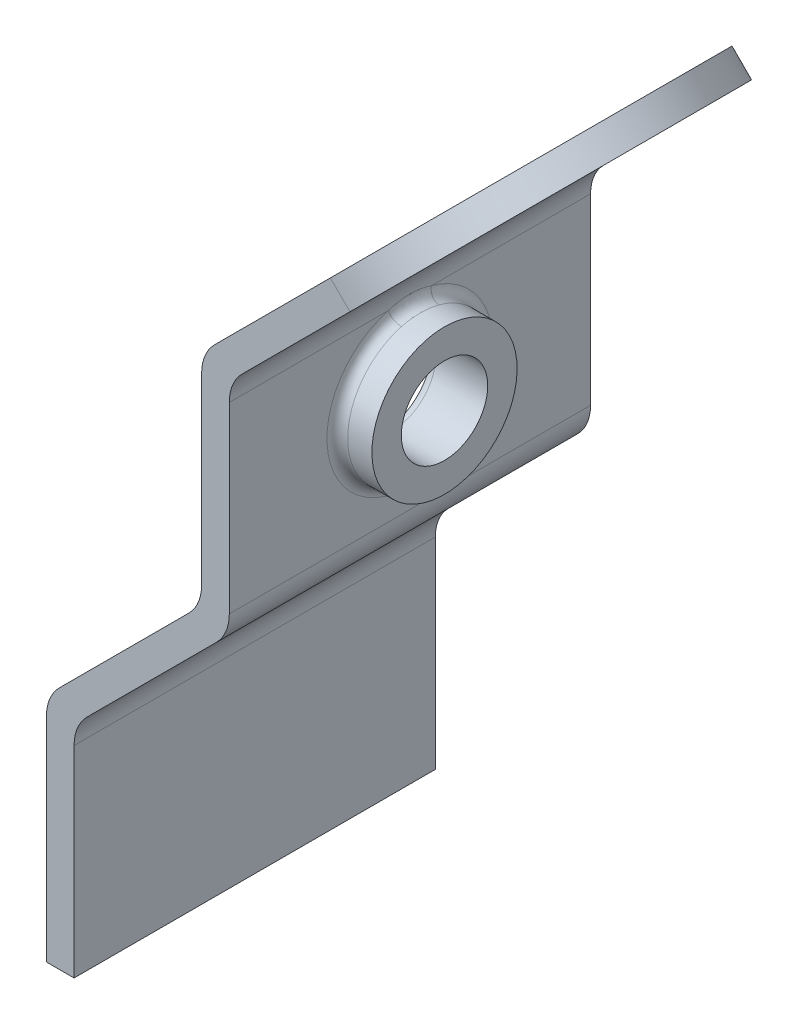
ISO-10303-21;
HEADER;
FILE_DESCRIPTION(('STEP AP214'),'2;1');
FILE_NAME('part.step','',(''),(''),'','','');
FILE_SCHEMA(('AUTOMOTIVE_DESIGN { 1 0 10303 214 1 1 1 1 }'));
ENDSEC;
DATA;
#1=APPLICATION_CONTEXT('core data for automotive mechanical design processes');
#2=APPLICATION_PROTOCOL_DEFINITION('international standard','automotive_design',2000,#1);
#3=PRODUCT_CONTEXT('',#1,'mechanical');
#4=PRODUCT('Part','Part','',(#3));
#5=PRODUCT_RELATED_PRODUCT_CATEGORY('part','',(#4));
#6=PRODUCT_DEFINITION_FORMATION('','',#4);
#7=PRODUCT_DEFINITION_CONTEXT('part definition',#1,'design');
#8=PRODUCT_DEFINITION('design','',#6,#7);
#9=PRODUCT_DEFINITION_SHAPE('','',#8);
#10=(LENGTH_UNIT() NAMED_UNIT(*) SI_UNIT(.MILLI.,.METRE.));
#11=(NAMED_UNIT(*) PLANE_ANGLE_UNIT() SI_UNIT($,.RADIAN.));
#12=(NAMED_UNIT(*) SI_UNIT($,.STERADIAN.) SOLID_ANGLE_UNIT());
#13=UNCERTAINTY_MEASURE_WITH_UNIT(LENGTH_MEASURE(1.E-05),#10,'distance_accuracy_value','');
#14=(GEOMETRIC_REPRESENTATION_CONTEXT(3) GLOBAL_UNCERTAINTY_ASSIGNED_CONTEXT((#13)) GLOBAL_UNIT_ASSIGNED_CONTEXT((#10,
#11,#12)) REPRESENTATION_CONTEXT('',''));
#15=CARTESIAN_POINT('',(0.,0.,0.));
#16=DIRECTION('',(0.,0.,1.));
#17=DIRECTION('',(1.,0.,0.));
#18=AXIS2_PLACEMENT_3D('',#15,#16,#17);
#19=CARTESIAN_POINT('',(10.5802561210692,22.7323585694968,-20.9));
#20=DIRECTION('',(1.,0.,0.));
#21=DIRECTION('',(0.,1.,0.));
#22=AXIS2_PLACEMENT_3D('',#19,#20,#21);
#23=PLANE('',#22);
#24=DIRECTION('',(0.,0.,1.));
#25=VECTOR('',#24,1.);
#26=CARTESIAN_POINT('',(10.5802561210692,33.3281536726415,-20.9));
#27=LINE('',#26,#25);
#28=CARTESIAN_POINT('',(10.5802561210692,33.3281536726415,-20.9));
#29=VERTEX_POINT('',#28);
#30=CARTESIAN_POINT('',(10.5802561210692,33.3281536726415,-11.6971287943723));
#31=VERTEX_POINT('',#30);
#32=EDGE_CURVE('E252',#29,#31,#27,.T.);
#33=ORIENTED_EDGE('',*,*,#32,.T.);
#34=CARTESIAN_POINT('',(10.5802561210692,28.6929978208661,-10.45));
#35=DIRECTION('',(1.,0.,0.));
#36=DIRECTION('',(0.,1.,0.));
#37=AXIS2_PLACEMENT_3D('',#34,#35,#36);
#38=CIRCLE('',#37,4.8);
#39=CARTESIAN_POINT('',(10.5802561210692,33.3281536726415,-9.20287120562774));
#40=VERTEX_POINT('',#39);
#41=EDGE_CURVE('E68',#31,#40,#38,.F.);
#42=ORIENTED_EDGE('',*,*,#41,.T.);
#43=CARTESIAN_POINT('',(10.5802561210692,33.3281536726415,0.));
#44=VERTEX_POINT('',#43);
#45=EDGE_CURVE('E254',#40,#44,#27,.T.);
#46=ORIENTED_EDGE('',*,*,#45,.T.);
#47=DIRECTION('',(0.,1.,0.));
#48=VECTOR('',#47,1.);
#49=CARTESIAN_POINT('',(10.5802561210692,22.7323585694968,0.));
#50=LINE('',#49,#48);
#51=CARTESIAN_POINT('',(10.5802561210692,22.7323585694968,0.));
#52=VERTEX_POINT('',#51);
#53=EDGE_CURVE('E386',#52,#44,#50,.T.);
#54=ORIENTED_EDGE('',*,*,#53,.F.);
#55=DIRECTION('',(0.,0.,1.));
#56=VECTOR('',#55,1.);
#57=CARTESIAN_POINT('',(10.5802561210692,22.7323585694968,-20.9));
#58=LINE('',#57,#56);
#59=CARTESIAN_POINT('',(10.5802561210692,22.7323585694968,-20.9));
#60=VERTEX_POINT('',#59);
#61=EDGE_CURVE('E255',#60,#52,#58,.T.);
#62=ORIENTED_EDGE('',*,*,#61,.F.);
#63=DIRECTION('',(0.,1.,0.));
#64=VECTOR('',#63,1.);
#65=CARTESIAN_POINT('',(10.5802561210692,22.7323585694968,-20.9));
#66=LINE('',#65,#64);
#67=EDGE_CURVE('E344',#60,#29,#66,.T.);
#68=ORIENTED_EDGE('',*,*,#67,.T.);
#69=EDGE_LOOP('',(#33,#42,#46,#54,#62,#68));
#70=FACE_BOUND('',#69,.T.);
#71=ADVANCED_FACE('F54',(#70),#23,.T.);
#72=CARTESIAN_POINT('',(23.8172950648814,49.8800367646782,-20.9));
#73=DIRECTION('',(-0.707106781186547,0.707106781186548,0.));
#74=DIRECTION('',(-0.707106781186548,-0.707106781186547,0.));
#75=AXIS2_PLACEMENT_3D('',#72,#73,#74);
#76=PLANE('',#75);
#77=DIRECTION('',(-0.707106781186548,-0.707106781186547,0.));
#78=VECTOR('',#77,1.);
#79=CARTESIAN_POINT('',(23.8172950648814,49.8800367646782,0.));
#80=LINE('',#79,#78);
#81=CARTESIAN_POINT('',(16.4280292014819,42.4907709012788,0.));
#82=VERTEX_POINT('',#81);
#83=CARTESIAN_POINT('',(9.72420489685533,35.7869465966522,0.));
#84=VERTEX_POINT('',#83);
#85=EDGE_CURVE('E203',#82,#84,#80,.T.);
#86=ORIENTED_EDGE('',*,*,#85,.F.);
#87=CARTESIAN_POINT('',(16.4280292014819,42.4907709012788,-10.45));
#88=DIRECTION('',(-0.707106781186547,0.707106781186548,0.));
#89=DIRECTION('',(-0.707106781186548,-0.707106781186547,0.));
#90=AXIS2_PLACEMENT_3D('',#87,#88,#89);
#91=CIRCLE('',#90,10.45);
#92=CARTESIAN_POINT('',(16.4280292014819,42.4907709012788,-20.9));
#93=VERTEX_POINT('',#92);
#94=EDGE_CURVE('E187',#82,#93,#91,.T.);
#95=ORIENTED_EDGE('',*,*,#94,.T.);
#96=DIRECTION('',(-0.707106781186548,-0.707106781186547,0.));
#97=VECTOR('',#96,1.);
#98=CARTESIAN_POINT('',(23.8172950648814,49.8800367646782,-20.9));
#99=LINE('',#98,#97);
#100=CARTESIAN_POINT('',(9.72420489685533,35.7869465966522,-20.9));
#101=VERTEX_POINT('',#100);
#102=EDGE_CURVE('E353',#93,#101,#99,.T.);
#103=ORIENTED_EDGE('',*,*,#102,.T.);
#104=DIRECTION('',(0.,0.,1.));
#105=VECTOR('',#104,1.);
#106=CARTESIAN_POINT('',(9.72420489685533,35.7869465966522,-20.9));
#107=LINE('',#106,#105);
#108=EDGE_CURVE('E212',#101,#84,#107,.T.);
#109=ORIENTED_EDGE('',*,*,#108,.T.);
#110=EDGE_LOOP('',(#86,#95,#103,#109));
#111=FACE_BOUND('',#110,.T.);
#112=ADVANCED_FACE('F210',(#111),#76,.T.);
#113=CARTESIAN_POINT('',(11.3242048968553,35.1242048968553,-20.9));
#114=DIRECTION('',(0.707106781186547,-0.707106781186548,0.));
#115=DIRECTION('',(0.707106781186548,0.707106781186547,0.));
#116=AXIS2_PLACEMENT_3D('',#113,#114,#115);
#117=PLANE('',#116);
#118=CARTESIAN_POINT('',(17.5594000513804,41.3594000513803,-10.45));
#119=DIRECTION('',(0.707106781186547,-0.707106781186548,0.));
#120=DIRECTION('',(0.707106781186548,0.707106781186547,0.));
#121=AXIS2_PLACEMENT_3D('',#118,#119,#120);
#122=CIRCLE('',#121,10.45);
#123=CARTESIAN_POINT('',(17.5594000513804,41.3594000513803,-20.9));
#124=VERTEX_POINT('',#123);
#125=CARTESIAN_POINT('',(17.5594000513804,41.3594000513803,0.));
#126=VERTEX_POINT('',#125);
#127=EDGE_CURVE('E197',#124,#126,#122,.T.);
#128=ORIENTED_EDGE('',*,*,#127,.T.);
#129=DIRECTION('',(0.707106781186549,0.707106781186547,0.));
#130=VECTOR('',#129,1.);
#131=CARTESIAN_POINT('',(11.3242048968553,35.1242048968553,0.));
#132=LINE('',#131,#130);
#133=CARTESIAN_POINT('',(11.3242048968553,35.1242048968553,0.));
#134=VERTEX_POINT('',#133);
#135=EDGE_CURVE('E207',#134,#126,#132,.T.);
#136=ORIENTED_EDGE('',*,*,#135,.F.);
#137=DIRECTION('',(0.,0.,1.));
#138=VECTOR('',#137,1.);
#139=CARTESIAN_POINT('',(11.3242048968553,35.1242048968553,-20.9));
#140=LINE('',#139,#138);
#141=CARTESIAN_POINT('',(11.3242048968553,35.1242048968553,-20.9));
#142=VERTEX_POINT('',#141);
#143=EDGE_CURVE('E250',#142,#134,#140,.T.);
#144=ORIENTED_EDGE('',*,*,#143,.F.);
#145=DIRECTION('',(0.707106781186549,0.707106781186547,0.));
#146=VECTOR('',#145,1.);
#147=CARTESIAN_POINT('',(11.3242048968553,35.1242048968553,-20.9));
#148=LINE('',#147,#146);
#149=EDGE_CURVE('E350',#142,#124,#148,.T.);
#150=ORIENTED_EDGE('',*,*,#149,.T.);
#151=EDGE_LOOP('',(#128,#136,#144,#150));
#152=FACE_BOUND('',#151,.T.);
#153=ADVANCED_FACE('F310',(#152),#117,.T.);
#154=CARTESIAN_POINT('',(0.,0.,-20.9));
#155=DIRECTION('',(0.,-1.,0.));
#156=DIRECTION('',(0.,0.,-1.));
#157=AXIS2_PLACEMENT_3D('',#154,#155,#156);
#158=PLANE('',#157);
#159=DIRECTION('',(1.,0.,0.));
#160=VECTOR('',#159,1.);
#161=CARTESIAN_POINT('',(0.,0.,0.));
#162=LINE('',#161,#160);
#163=CARTESIAN_POINT('',(0.,0.,0.));
#164=VERTEX_POINT('',#163);
#165=CARTESIAN_POINT('',(1.6,0.,0.));
#166=VERTEX_POINT('',#165);
#167=EDGE_CURVE('E329',#164,#166,#162,.T.);
#168=ORIENTED_EDGE('',*,*,#167,.F.);
#169=DIRECTION('',(0.,0.,1.));
#170=VECTOR('',#169,1.);
#171=CARTESIAN_POINT('',(0.,0.,-20.9));
#172=LINE('',#171,#170);
#173=CARTESIAN_POINT('',(0.,0.,-20.9));
#174=VERTEX_POINT('',#173);
#175=EDGE_CURVE('E237',#174,#164,#172,.T.);
#176=ORIENTED_EDGE('',*,*,#175,.F.);
#177=DIRECTION('',(1.,0.,0.));
#178=VECTOR('',#177,1.);
#179=CARTESIAN_POINT('',(0.,0.,-20.9));
#180=LINE('',#179,#178);
#181=CARTESIAN_POINT('',(1.6,0.,-20.9));
#182=VERTEX_POINT('',#181);
#183=EDGE_CURVE('E236',#174,#182,#180,.T.);
#184=ORIENTED_EDGE('',*,*,#183,.T.);
#185=DIRECTION('',(0.,0.,1.));
#186=VECTOR('',#185,1.);
#187=CARTESIAN_POINT('',(1.6,0.,-20.9));
#188=LINE('',#187,#186);
#189=EDGE_CURVE('E263',#182,#166,#188,.T.);
#190=ORIENTED_EDGE('',*,*,#189,.T.);
#191=EDGE_LOOP('',(#168,#176,#184,#190));
#192=FACE_BOUND('',#191,.T.);
#193=ADVANCED_FACE('F291',(#192),#158,.T.);
#194=CARTESIAN_POINT('',(0.,12.3106392513693,-20.9));
#195=DIRECTION('',(-1.,0.,0.));
#196=DIRECTION('',(0.,-1.,0.));
#197=AXIS2_PLACEMENT_3D('',#194,#195,#196);
#198=PLANE('',#197);
#199=DIRECTION('',(0.,-1.,0.));
#200=VECTOR('',#199,1.);
#201=CARTESIAN_POINT('',(0.,12.3106392513693,0.));
#202=LINE('',#201,#200);
#203=CARTESIAN_POINT('',(0.,12.3106392513693,0.));
#204=VERTEX_POINT('',#203);
#205=EDGE_CURVE('E233',#204,#164,#202,.T.);
#206=ORIENTED_EDGE('',*,*,#205,.F.);
#207=DIRECTION('',(0.,0.,1.));
#208=VECTOR('',#207,1.);
#209=CARTESIAN_POINT('',(0.,12.3106392513693,-20.9));
#210=LINE('',#209,#208);
#211=CARTESIAN_POINT('',(0.,12.3106392513693,-20.9));
#212=VERTEX_POINT('',#211);
#213=EDGE_CURVE('E239',#212,#204,#210,.T.);
#214=ORIENTED_EDGE('',*,*,#213,.F.);
#215=DIRECTION('',(0.,-1.,0.));
#216=VECTOR('',#215,1.);
#217=CARTESIAN_POINT('',(0.,12.3106392513693,-20.9));
#218=LINE('',#217,#216);
#219=EDGE_CURVE('E265',#212,#174,#218,.T.);
#220=ORIENTED_EDGE('',*,*,#219,.T.);
#221=ORIENTED_EDGE('',*,*,#175,.T.);
#222=EDGE_LOOP('',(#206,#214,#220,#221));
#223=FACE_BOUND('',#222,.T.);
#224=ADVANCED_FACE('F413',(#223),#198,.T.);
#225=CARTESIAN_POINT('',(2.54,12.3106392513693,-20.9));
#226=DIRECTION('',(0.,0.,1.));
#227=DIRECTION('',(1.,0.,0.));
#228=AXIS2_PLACEMENT_3D('',#225,#226,#227);
#229=CYLINDRICAL_SURFACE('',#228,2.54);
#230=CARTESIAN_POINT('',(2.54,12.3106392513693,0.));
#231=DIRECTION('',(0.,0.,1.));
#232=DIRECTION('',(1.,0.,0.));
#233=AXIS2_PLACEMENT_3D('',#230,#231,#232);
#234=CIRCLE('',#233,2.54);
#235=CARTESIAN_POINT('',(0.743948775786169,14.1066904755831,0.));
#236=VERTEX_POINT('',#235);
#237=EDGE_CURVE('E230',#236,#204,#234,.T.);
#238=ORIENTED_EDGE('',*,*,#237,.F.);
#239=DIRECTION('',(0.,0.,1.));
#240=VECTOR('',#239,1.);
#241=CARTESIAN_POINT('',(0.743948775786169,14.1066904755831,-20.9));
#242=LINE('',#241,#240);
#243=CARTESIAN_POINT('',(0.743948775786169,14.1066904755831,-20.9));
#244=VERTEX_POINT('',#243);
#245=EDGE_CURVE('E241',#244,#236,#242,.T.);
#246=ORIENTED_EDGE('',*,*,#245,.F.);
#247=CARTESIAN_POINT('',(2.54,12.3106392513693,-20.9));
#248=DIRECTION('',(0.,0.,1.));
#249=DIRECTION('',(1.,0.,0.));
#250=AXIS2_PLACEMENT_3D('',#247,#248,#249);
#251=CIRCLE('',#250,2.54);
#252=EDGE_CURVE('E367',#244,#212,#251,.T.);
#253=ORIENTED_EDGE('',*,*,#252,.T.);
#254=ORIENTED_EDGE('',*,*,#213,.T.);
#255=EDGE_LOOP('',(#238,#246,#253,#254));
#256=FACE_BOUND('',#255,.T.);
#257=ADVANCED_FACE('F451',(#256),#229,.T.);
#258=CARTESIAN_POINT('',(8.23630734528299,21.5990490450799,-20.9));
#259=DIRECTION('',(-0.707106781186546,0.707106781186549,0.));
#260=DIRECTION('',(-0.707106781186549,-0.707106781186546,0.));
#261=AXIS2_PLACEMENT_3D('',#258,#259,#260);
#262=PLANE('',#261);
#263=DIRECTION('',(-0.707106781186549,-0.707106781186546,0.));
#264=VECTOR('',#263,1.);
#265=CARTESIAN_POINT('',(8.23630734528299,21.5990490450799,0.));
#266=LINE('',#265,#264);
#267=CARTESIAN_POINT('',(8.23630734528299,21.5990490450799,0.));
#268=VERTEX_POINT('',#267);
#269=EDGE_CURVE('E227',#268,#236,#266,.T.);
#270=ORIENTED_EDGE('',*,*,#269,.F.);
#271=DIRECTION('',(0.,0.,1.));
#272=VECTOR('',#271,1.);
#273=CARTESIAN_POINT('',(8.23630734528299,21.5990490450799,-20.9));
#274=LINE('',#273,#272);
#275=CARTESIAN_POINT('',(8.23630734528299,21.5990490450799,-20.9));
#276=VERTEX_POINT('',#275);
#277=EDGE_CURVE('E243',#276,#268,#274,.T.);
#278=ORIENTED_EDGE('',*,*,#277,.F.);
#279=DIRECTION('',(-0.707106781186549,-0.707106781186546,0.));
#280=VECTOR('',#279,1.);
#281=CARTESIAN_POINT('',(8.23630734528299,21.5990490450799,-20.9));
#282=LINE('',#281,#280);
#283=EDGE_CURVE('E364',#276,#244,#282,.T.);
#284=ORIENTED_EDGE('',*,*,#283,.T.);
#285=ORIENTED_EDGE('',*,*,#245,.T.);
#286=EDGE_LOOP('',(#270,#278,#284,#285));
#287=FACE_BOUND('',#286,.T.);
#288=ADVANCED_FACE('F408',(#287),#262,.T.);
#289=CARTESIAN_POINT('',(6.44025612106916,23.3951002692938,-20.9));
#290=DIRECTION('',(0.,0.,1.));
#291=DIRECTION('',(1.,0.,0.));
#292=AXIS2_PLACEMENT_3D('',#289,#290,#291);
#293=CYLINDRICAL_SURFACE('',#292,2.54);
#294=CARTESIAN_POINT('',(6.44025612106916,23.3951002692938,0.));
#295=DIRECTION('',(0.,0.,-1.));
#296=DIRECTION('',(-1.,0.,0.));
#297=AXIS2_PLACEMENT_3D('',#294,#295,#296);
#298=CIRCLE('',#297,2.54);
#299=CARTESIAN_POINT('',(8.98025612106916,23.3951002692938,0.));
#300=VERTEX_POINT('',#299);
#301=EDGE_CURVE('E224',#300,#268,#298,.T.);
#302=ORIENTED_EDGE('',*,*,#301,.F.);
#303=DIRECTION('',(0.,0.,1.));
#304=VECTOR('',#303,1.);
#305=CARTESIAN_POINT('',(8.98025612106916,23.3951002692938,-20.9));
#306=LINE('',#305,#304);
#307=CARTESIAN_POINT('',(8.98025612106916,23.3951002692938,-20.9));
#308=VERTEX_POINT('',#307);
#309=EDGE_CURVE('E245',#308,#300,#306,.T.);
#310=ORIENTED_EDGE('',*,*,#309,.F.);
#311=CARTESIAN_POINT('',(6.44025612106916,23.3951002692938,-20.9));
#312=DIRECTION('',(0.,0.,-1.));
#313=DIRECTION('',(-1.,0.,0.));
#314=AXIS2_PLACEMENT_3D('',#311,#312,#313);
#315=CIRCLE('',#314,2.54);
#316=EDGE_CURVE('E361',#308,#276,#315,.T.);
#317=ORIENTED_EDGE('',*,*,#316,.T.);
#318=ORIENTED_EDGE('',*,*,#277,.T.);
#319=EDGE_LOOP('',(#302,#310,#317,#318));
#320=FACE_BOUND('',#319,.T.);
#321=ADVANCED_FACE('F404',(#320),#293,.F.);
#322=CARTESIAN_POINT('',(8.98025612106916,33.9908953724384,-20.9));
#323=DIRECTION('',(-1.,0.,0.));
#324=DIRECTION('',(0.,-1.,0.));
#325=AXIS2_PLACEMENT_3D('',#322,#323,#324);
#326=PLANE('',#325);
#327=CARTESIAN_POINT('',(8.98025612106916,28.6929978208661,-10.45));
#328=DIRECTION('',(-1.,0.,0.));
#329=DIRECTION('',(0.,-1.,0.));
#330=AXIS2_PLACEMENT_3D('',#327,#328,#329);
#331=CIRCLE('',#330,3.1);
#332=CARTESIAN_POINT('',(8.98025612106916,25.5929978208661,-10.45));
#333=VERTEX_POINT('',#332);
#334=EDGE_CURVE('E269',#333,#333,#331,.F.);
#335=ORIENTED_EDGE('',*,*,#334,.T.);
#336=EDGE_LOOP('',(#335));
#337=FACE_BOUND('',#336,.T.);
#338=DIRECTION('',(0.,-1.,0.));
#339=VECTOR('',#338,1.);
#340=CARTESIAN_POINT('',(8.98025612106916,33.9908953724384,0.));
#341=LINE('',#340,#339);
#342=CARTESIAN_POINT('',(8.98025612106916,33.9908953724384,0.));
#343=VERTEX_POINT('',#342);
#344=EDGE_CURVE('E216',#343,#300,#341,.T.);
#345=ORIENTED_EDGE('',*,*,#344,.F.);
#346=DIRECTION('',(0.,0.,1.));
#347=VECTOR('',#346,1.);
#348=CARTESIAN_POINT('',(8.98025612106916,33.9908953724384,-20.9));
#349=LINE('',#348,#347);
#350=CARTESIAN_POINT('',(8.98025612106916,33.9908953724384,-20.9));
#351=VERTEX_POINT('',#350);
#352=EDGE_CURVE('E247',#351,#343,#349,.T.);
#353=ORIENTED_EDGE('',*,*,#352,.F.);
#354=DIRECTION('',(0.,-1.,0.));
#355=VECTOR('',#354,1.);
#356=CARTESIAN_POINT('',(8.98025612106916,33.9908953724384,-20.9));
#357=LINE('',#356,#355);
#358=EDGE_CURVE('E358',#351,#308,#357,.T.);
#359=ORIENTED_EDGE('',*,*,#358,.T.);
#360=ORIENTED_EDGE('',*,*,#309,.T.);
#361=EDGE_LOOP('',(#345,#353,#359,#360));
#362=FACE_BOUND('',#361,.T.);
#363=ADVANCED_FACE('F401',(#337,#362),#326,.T.);
#364=CARTESIAN_POINT('',(11.5202561210692,33.9908953724384,-20.9));
#365=DIRECTION('',(0.,0.,1.));
#366=DIRECTION('',(1.,0.,0.));
#367=AXIS2_PLACEMENT_3D('',#364,#365,#366);
#368=CYLINDRICAL_SURFACE('',#367,2.54);
#369=CARTESIAN_POINT('',(11.5202561210692,33.9908953724384,0.));
#370=DIRECTION('',(0.,0.,1.));
#371=DIRECTION('',(1.,0.,0.));
#372=AXIS2_PLACEMENT_3D('',#369,#370,#371);
#373=CIRCLE('',#372,2.54);
#374=EDGE_CURVE('E214',#84,#343,#373,.T.);
#375=ORIENTED_EDGE('',*,*,#374,.F.);
#376=ORIENTED_EDGE('',*,*,#108,.F.);
#377=CARTESIAN_POINT('',(11.5202561210692,33.9908953724384,-20.9));
#378=DIRECTION('',(0.,0.,1.));
#379=DIRECTION('',(1.,0.,0.));
#380=AXIS2_PLACEMENT_3D('',#377,#378,#379);
#381=CIRCLE('',#380,2.54);
#382=EDGE_CURVE('E355',#101,#351,#381,.T.);
#383=ORIENTED_EDGE('',*,*,#382,.T.);
#384=ORIENTED_EDGE('',*,*,#352,.T.);
#385=EDGE_LOOP('',(#375,#376,#383,#384));
#386=FACE_BOUND('',#385,.T.);
#387=ADVANCED_FACE('F308',(#386),#368,.T.);
#388=CARTESIAN_POINT('',(13.1202561210692,33.3281536726415,-20.9));
#389=DIRECTION('',(0.,0.,1.));
#390=DIRECTION('',(1.,0.,0.));
#391=AXIS2_PLACEMENT_3D('',#388,#389,#390);
#392=CYLINDRICAL_SURFACE('',#391,2.54);
#393=ORIENTED_EDGE('',*,*,#45,.F.);
#394=CARTESIAN_POINT('',(11.2775078538272,32.2180453094019,-12.7334272932518));
#395=CARTESIAN_POINT('',(10.8260491574233,32.1741235022297,-12.8012317101132));
#396=CARTESIAN_POINT('',(10.7075857093193,32.534036877537,-13.0596311922878));
#397=CARTESIAN_POINT('',(11.2580523767097,32.2699206425587,-12.6533942841327));
#398=CARTESIAN_POINT('',(10.7937907819477,32.2331836147482,-12.7135117701608));
#399=CARTESIAN_POINT('',(10.6821130757417,32.6116588786999,-12.9681648962105));
#400=CARTESIAN_POINT('',(11.2425822940814,32.3193103017998,-12.5711263801209));
#401=CARTESIAN_POINT('',(10.7660906248619,32.2882450119713,-12.6245785382055));
#402=CARTESIAN_POINT('',(10.6618584315249,32.6855615205437,-12.8741444344879));
#403=CARTESIAN_POINT('',(11.2178809343335,32.4125808921157,-12.4029156733101));
#404=CARTESIAN_POINT('',(10.717430545466,32.391402145407,-12.4437107783533));
#405=CARTESIAN_POINT('',(10.6295174753223,32.8251239942297,-12.68190362668));
#406=CARTESIAN_POINT('',(11.2086442125996,32.4564666033347,-12.3169761474992));
#407=CARTESIAN_POINT('',(10.6965896166801,32.4393730687844,-12.3517303121185));
#408=CARTESIAN_POINT('',(10.6174240348217,32.8907909786886,-12.583687025724));
#409=CARTESIAN_POINT('',(11.1947158542805,32.5378973760808,-12.1429018867758));
#410=CARTESIAN_POINT('',(10.6601485175915,32.5276190140171,-12.1666802144119));
#411=CARTESIAN_POINT('',(10.5991879366187,33.0126373189215,-12.3847450134476));
#412=CARTESIAN_POINT('',(11.189982046186,32.575498494785,-12.0547956108171));
#413=CARTESIAN_POINT('',(10.6446041008984,32.5678012457572,-12.0736595424521));
#414=CARTESIAN_POINT('',(10.5929900646609,33.0689005540621,-12.2840521266458));
#415=CARTESIAN_POINT('',(11.1835049708901,32.6446077482351,-11.8761631633722));
#416=CARTESIAN_POINT('',(10.617352824279,32.6410659349035,-11.8863664493524));
#417=CARTESIAN_POINT('',(10.5845097702311,33.1723099819413,-12.0799007581426));
#418=CARTESIAN_POINT('',(11.1817609323128,32.6761174527354,-11.7856376221921));
#419=CARTESIAN_POINT('',(10.6057337887405,32.6739670917682,-11.7922269679158));
#420=CARTESIAN_POINT('',(10.5822263378135,33.2194585235318,-11.9764429967914));
#421=CARTESIAN_POINT('',(11.1806819439876,32.7123472402715,-11.668825151));
#422=CARTESIAN_POINT('',(10.5928900718615,32.711311679181,-11.6722602719185));
#423=CARTESIAN_POINT('',(10.5808136418082,33.2736698109133,-11.8429430297142));
#424=CARTESIAN_POINT('',(11.1805168872852,32.7199643968682,-11.643416823191));
#425=CARTESIAN_POINT('',(10.5902078692293,32.719179562324,-11.6460811046578));
#426=CARTESIAN_POINT('',(10.5805975366905,33.2850675003145,-11.8139049407897));
#427=CARTESIAN_POINT('',(11.1803041551556,32.7347219042148,-11.5924408445954));
#428=CARTESIAN_POINT('',(10.5850652047428,32.7343812484922,-11.5936645069745));
#429=CARTESIAN_POINT('',(10.5803190111259,33.3071494258888,-11.7556466795377));
#430=CARTESIAN_POINT('',(11.1802565693442,32.7418618869029,-11.5668730870806));
#431=CARTESIAN_POINT('',(10.5826063558554,32.7417108770954,-11.5674321813049));
#432=CARTESIAN_POINT('',(10.580256708011,33.3178331113242,-11.726426385235));
#433=CARTESIAN_POINT('',(11.1802541318673,32.7793656888156,-11.4274817210431));
#434=CARTESIAN_POINT('',(10.5697148300781,32.7803723432194,-11.4237499856287));
#435=CARTESIAN_POINT('',(10.5802535165394,33.3739507294989,-11.5671219669064));
#436=CARTESIAN_POINT('',(11.1811803294513,32.8051935976453,-11.3123939540302));
#437=CARTESIAN_POINT('',(10.5613820579649,32.8062548892592,-11.3073078735361));
#438=CARTESIAN_POINT('',(10.5814661672138,33.4125974973455,-11.4355930903202));
#439=CARTESIAN_POINT('',(11.1833656953447,32.8470931737154,-11.0803990582023));
#440=CARTESIAN_POINT('',(10.5480212856553,32.8481117959283,-11.0739575291851));
#441=CARTESIAN_POINT('',(10.5843274195273,33.475292592027,-11.1704560665169));
#442=CARTESIAN_POINT('',(11.1846251044633,32.8631577572827,-10.9634906713792));
#443=CARTESIAN_POINT('',(10.5430759233576,32.8638334300432,-10.9576868684035));
#444=CARTESIAN_POINT('',(10.5859763364527,33.4993303194335,-11.0368464815763));
#445=CARTESIAN_POINT('',(11.1865099224934,32.8854108747262,-10.7285781347404));
#446=CARTESIAN_POINT('',(10.5362193499767,32.8856660853559,-10.7245442279511));
#447=CARTESIAN_POINT('',(10.5884440878706,33.5326280621742,-10.7683750111319));
#448=CARTESIAN_POINT('',(11.1871345403335,32.8915870913054,-10.6105728021773));
#449=CARTESIAN_POINT('',(10.5343559244339,32.8916253821386,-10.6084090229544));
#450=CARTESIAN_POINT('',(10.5892618866311,33.5418696469138,-10.6335117739169));
#451=CARTESIAN_POINT('',(11.1873681072824,32.8939775411525,-10.3745199154819));
#452=CARTESIAN_POINT('',(10.5336285095313,32.8939515928932,-10.3754640520442));
#453=CARTESIAN_POINT('',(10.5895676907934,33.54544652032,-10.3637370462651));
#454=CARTESIAN_POINT('',(11.1869775239409,32.8901963602774,-10.2564724058119));
#455=CARTESIAN_POINT('',(10.5347679455601,32.890307552617,-10.2594292276539));
#456=CARTESIAN_POINT('',(10.589056308348,33.5397886708877,-10.2288256066425));
#457=CARTESIAN_POINT('',(11.185312955575,32.871657912752,-10.0069805267081));
#458=CARTESIAN_POINT('',(10.5404491366725,32.8721838145585,-10.0124327072074));
#459=CARTESIAN_POINT('',(10.5868769249943,33.5120492560474,-9.9436920305232));
#460=CARTESIAN_POINT('',(11.1839385576132,32.8556375933182,-9.87562896944069));
#461=CARTESIAN_POINT('',(10.5453381358532,32.8565985340662,-9.88225427619368));
#462=CARTESIAN_POINT('',(10.5850774556311,33.4880777618796,-9.79357596507373));
#463=CARTESIAN_POINT('',(11.181408949582,32.8113199333874,-9.6152328864585));
#464=CARTESIAN_POINT('',(10.5593885515555,32.8124365526125,-9.62082969872009));
#465=CARTESIAN_POINT('',(10.5817654943653,33.4217644444879,-9.49598044166819));
#466=CARTESIAN_POINT('',(11.1802533796152,32.7830430072828,-9.48618489448167));
#467=CARTESIAN_POINT('',(10.5684364146698,32.7842101124853,-9.49050362552364));
#468=CARTESIAN_POINT('',(10.5802525312577,33.3794531676895,-9.34849702226978));
#469=CARTESIAN_POINT('',(11.180258388065,32.7204088082085,-9.25339249428527));
#470=CARTESIAN_POINT('',(10.5898574929933,32.7199617346925,-9.25174632888251));
#471=CARTESIAN_POINT('',(10.5802590895989,33.285732481094,-9.0824485648933));
#472=CARTESIAN_POINT('',(11.1810527274672,32.6879508150325,-9.14913416056226));
#473=CARTESIAN_POINT('',(10.601253296544,32.6865012069801,-9.14419044513827));
#474=CARTESIAN_POINT('',(10.5812991019655,33.2371649980306,-8.9632961834855));
#475=CARTESIAN_POINT('',(11.1858341313062,32.6150371326497,-8.94351249012573));
#476=CARTESIAN_POINT('',(10.6287314783484,32.6099174966976,-8.92991444357716));
#477=CARTESIAN_POINT('',(10.587559290175,33.1280629341249,-8.72829998872838));
#478=CARTESIAN_POINT('',(11.1898207867006,32.5745824685839,-8.84214878423687));
#479=CARTESIAN_POINT('',(10.6446930435603,32.5670681436151,-8.82344485934275));
#480=CARTESIAN_POINT('',(10.5927789304678,33.0675298872196,-8.61245575346439));
#481=CARTESIAN_POINT('',(11.2030100861391,32.4856562580273,-8.64229949489166));
#482=CARTESIAN_POINT('',(10.683034254348,32.4712738937128,-8.6117688614955));
#483=CARTESIAN_POINT('',(10.610047395168,32.9344679879333,-8.38405656553926));
#484=CARTESIAN_POINT('',(11.2122517896091,32.4371266251848,-8.54384133886634));
#485=CARTESIAN_POINT('',(10.7053114793828,32.4185104847598,-8.50666821016905));
#486=CARTESIAN_POINT('',(10.6221473592596,32.8618522198991,-8.27153295851225));
#487=CARTESIAN_POINT('',(11.231863957961,32.3589131791823,-8.39961796205613));
#488=CARTESIAN_POINT('',(10.7453895923585,32.3317784034554,-8.3509870895541));
#489=CARTESIAN_POINT('',(10.6478251460049,32.7448200234807,-8.10670624222961));
#490=CARTESIAN_POINT('',(11.2393684637464,32.331913555983,-8.35208181047684));
#491=CARTESIAN_POINT('',(10.7597380273724,32.3018349532772,-8.29976737284915));
#492=CARTESIAN_POINT('',(10.6576506321626,32.7044199978488,-8.05237921192463));
#493=CARTESIAN_POINT('',(11.2566478744233,32.2762197621353,-8.25831128595054));
#494=CARTESIAN_POINT('',(10.7909216765811,32.2397023950123,-8.19848554335118));
#495=CARTESIAN_POINT('',(10.6802741893857,32.6210843647656,-7.94521289827575));
#496=CARTESIAN_POINT('',(11.2664237294882,32.2475248860686,-8.21207746690902));
#497=CARTESIAN_POINT('',(10.8077343352305,32.207532266539,-8.14840819664612));
#498=CARTESIAN_POINT('',(10.6930735044926,32.5781477017841,-7.89237424796668));
#499=CARTESIAN_POINT('',(11.2775078538272,32.2180453094019,-8.1665727067482));
#500=CARTESIAN_POINT('',(10.8260491574233,32.1741235022297,-8.0987682898868));
#501=CARTESIAN_POINT('',(10.7075857093193,32.534036877537,-7.84036880771223));
#502=(BOUNDED_SURFACE() B_SPLINE_SURFACE(3,2,((#394,#395,#396),(#397,#398,#399),(#400,#401,
#402),(#403,#404,#405),(#406,#407,#408),(#409,#410,#411),(#412,#413,#414),(#415,#416,#417),
(#418,#419,#420),(#421,#422,#423),(#424,#425,#426),(#427,#428,#429),(#430,#431,#432),(#433,#434,
#435),(#436,#437,#438),(#439,#440,#441),(#442,#443,#444),(#445,#446,#447),(#448,#449,#450),
(#451,#452,#453),(#454,#455,#456),(#457,#458,#459),(#460,#461,#462),(#463,#464,#465),(#466,#467,
#468),(#469,#470,#471),(#472,#473,#474),(#475,#476,#477),(#478,#479,#480),(#481,#482,#483),
(#484,#485,#486),(#487,#488,#489),(#490,#491,#492),(#493,#494,#495),(#496,#497,#498),(#499,#500,
#501)),.UNSPECIFIED.,.F.,.F.,.F.) B_SPLINE_SURFACE_WITH_KNOTS((4,2,2,2,2,2,2,2,2,2,2,2,2,2,2,2,
2,4),(3,3),(0.,0.331874201120749,0.663458145682873,0.991905183764777,1.32026746805021,
1.41121006638871,1.50222202125563,1.90608374385047,2.31023813514567,2.714895564754,
3.11936666288323,3.57238921651035,4.02466010570663,4.39865735468485,4.77260668978403,
5.14937252180306,5.33807711724488,5.52686079605431),(0.,1.),
.UNSPECIFIED.) GEOMETRIC_REPRESENTATION_ITEM() RATIONAL_B_SPLINE_SURFACE(((1.,0.794481440906599,
1.),(1.,0.787631474744811,1.),(1.,0.780653496274145,1.),(1.,0.766741995702262,1.),(1.,
0.759808440057197,1.),(1.,0.746337278907262,1.),(1.,0.739796548111348,1.),(1.,0.727314365115548,
1.),(1.,0.721372758710924,1.),(1.,0.71433221830749,1.),(1.,0.712838039177156,1.),(1.,
0.709918876316959,1.),(1.,0.708493946227371,1.),(1.,0.70095129464932,1.),(1.,0.69553944093549,
1.),(1.,0.686588259108845,1.),(1.,0.683050290811537,1.),(1.,0.678112759072646,1.),(1.,
0.676715862717636,1.),(1.,0.676177405195194,1.),(1.,0.677034805816037,1.),(1.,0.681172491861099,
1.),(1.,0.684731258696012,1.),(1.,0.694253024619885,1.),(1.,0.700212024759416,1.),(1.,
0.712808275573472,1.),(1.,0.719149655505198,1.),(1.,0.732748651204891,1.),(1.,0.740006149487132,
1.),(1.,0.755101012064303,1.),(1.,0.76294233207215,1.),(1.,0.774784418084955,1.),(1.,
0.778748541193051,1.),(1.,0.786649388101726,1.),(1.,0.790586099723421,1.),(1.,0.794481440906599,1.))) REPRESENTATION_ITEM('') SURFACE());
#503=CARTESIAN_POINT('',(10.7075857093193,32.534036877537,-7.84036880771223));
#504=CARTESIAN_POINT('',(10.6930735044926,32.5781477017841,-7.89237424796668));
#505=CARTESIAN_POINT('',(10.6802741893857,32.6210843647655,-7.94521289827575));
#506=CARTESIAN_POINT('',(10.6576506321626,32.7044199978488,-8.05237921192463));
#507=CARTESIAN_POINT('',(10.6478251460049,32.7448200234807,-8.10670624222961));
#508=CARTESIAN_POINT('',(10.6221473592596,32.8618522198991,-8.27153295851225));
#509=CARTESIAN_POINT('',(10.610047395168,32.9344679879333,-8.38405656553926));
#510=CARTESIAN_POINT('',(10.5927789304678,33.0675298872196,-8.61245575346439));
#511=CARTESIAN_POINT('',(10.587559290175,33.1280629341249,-8.72829998872838));
#512=CARTESIAN_POINT('',(10.5812991019655,33.2371649980306,-8.9632961834855));
#513=CARTESIAN_POINT('',(10.5802590895989,33.285732481094,-9.0824485648933));
#514=CARTESIAN_POINT('',(10.5802525312577,33.3794531676895,-9.34849702226978));
#515=CARTESIAN_POINT('',(10.5817654943653,33.4217644444879,-9.49598044166819));
#516=CARTESIAN_POINT('',(10.5850774556311,33.4880777618796,-9.79357596507373));
#517=CARTESIAN_POINT('',(10.5868769249943,33.5120492560474,-9.9436920305232));
#518=CARTESIAN_POINT('',(10.589056308348,33.5397886708877,-10.2288256066425));
#519=CARTESIAN_POINT('',(10.5895676907934,33.54544652032,-10.3637370462651));
#520=CARTESIAN_POINT('',(10.5892618866311,33.5418696469138,-10.6335117739169));
#521=CARTESIAN_POINT('',(10.5884440878706,33.5326280621742,-10.7683750111319));
#522=CARTESIAN_POINT('',(10.5859763364527,33.4993303194335,-11.0368464815763));
#523=CARTESIAN_POINT('',(10.5843274195273,33.475292592027,-11.1704560665169));
#524=CARTESIAN_POINT('',(10.5814661672138,33.4125974973455,-11.4355930903202));
#525=CARTESIAN_POINT('',(10.5802535165394,33.3739507294989,-11.5671219669064));
#526=CARTESIAN_POINT('',(10.580256708011,33.3178331113242,-11.726426385235));
#527=CARTESIAN_POINT('',(10.5803190111259,33.3071494258888,-11.7556466795377));
#528=CARTESIAN_POINT('',(10.5805975366905,33.2850675003145,-11.8139049407897));
#529=CARTESIAN_POINT('',(10.5808136418082,33.2736698109133,-11.8429430297142));
#530=CARTESIAN_POINT('',(10.5822263378135,33.2194585235318,-11.9764429967914));
#531=CARTESIAN_POINT('',(10.5845097702311,33.1723099819413,-12.0799007581426));
#532=CARTESIAN_POINT('',(10.5929900646609,33.0689005540621,-12.2840521266458));
#533=CARTESIAN_POINT('',(10.5991879366187,33.0126373189215,-12.3847450134476));
#534=CARTESIAN_POINT('',(10.6174240348217,32.8907909786886,-12.583687025724));
#535=CARTESIAN_POINT('',(10.6295174753223,32.8251239942297,-12.68190362668));
#536=CARTESIAN_POINT('',(10.6618584315249,32.6855615205437,-12.8741444344879));
#537=CARTESIAN_POINT('',(10.6821130757417,32.6116588786999,-12.9681648962105));
#538=CARTESIAN_POINT('',(10.7075857093193,32.534036877537,-13.0596311922878));
#539=B_SPLINE_CURVE_WITH_KNOTS('',3,(#503,#504,#505,#506,#507,#508,#509,#510,#511,#512,#513,
#514,#515,#516,#517,#518,#519,#520,#521,#522,#523,#524,#525,#526,#527,#528,#529,#530,#531,#532,
#533,#534,#535,#536,#537,#538),.UNSPECIFIED.,.F.,.F.,(4,2,2,2,2,2,2,2,2,2,2,2,2,2,2,2,2,4),(0.,
0.18878367880943,0.377488274251256,0.754254106270279,1.12820344136946,1.50220069034768,
1.95447157954396,2.40749413317109,2.81196523130031,3.21662266090864,3.62077705220385,
4.02463877479868,4.1156507296656,4.2065933280041,4.53495561228954,4.86340265037144,
5.19498659493356,5.52686079605431),.UNSPECIFIED.);
#540=EDGE_CURVE('E12',#40,#31,#539,.T.);
#541=ORIENTED_EDGE('',*,*,#540,.T.);
#542=ORIENTED_EDGE('',*,*,#32,.F.);
#543=CARTESIAN_POINT('',(13.1202561210692,33.3281536726415,-20.9));
#544=DIRECTION('',(0.,0.,-1.));
#545=DIRECTION('',(-1.,0.,0.));
#546=AXIS2_PLACEMENT_3D('',#543,#544,#545);
#547=CIRCLE('',#546,2.54);
#548=EDGE_CURVE('E347',#29,#142,#547,.T.);
#549=ORIENTED_EDGE('',*,*,#548,.T.);
#550=ORIENTED_EDGE('',*,*,#143,.T.);
#551=CARTESIAN_POINT('',(13.1202561210692,33.3281536726415,0.));
#552=DIRECTION('',(0.,0.,-1.));
#553=DIRECTION('',(-1.,0.,0.));
#554=AXIS2_PLACEMENT_3D('',#551,#552,#553);
#555=CIRCLE('',#554,2.54);
#556=EDGE_CURVE('E218',#44,#134,#555,.T.);
#557=ORIENTED_EDGE('',*,*,#556,.F.);
#558=EDGE_LOOP('',(#393,#541,#542,#549,#550,#557));
#559=FACE_BOUND('',#558,.T.);
#560=ADVANCED_FACE('F302',(#559),#392,.F.);
#561=CARTESIAN_POINT('',(8.04025612106916,22.7323585694968,-20.9));
#562=DIRECTION('',(0.,0.,1.));
#563=DIRECTION('',(1.,0.,0.));
#564=AXIS2_PLACEMENT_3D('',#561,#562,#563);
#565=CYLINDRICAL_SURFACE('',#564,2.54);
#566=CARTESIAN_POINT('',(8.04025612106916,22.7323585694968,0.));
#567=DIRECTION('',(0.,0.,1.));
#568=DIRECTION('',(1.,0.,0.));
#569=AXIS2_PLACEMENT_3D('',#566,#567,#568);
#570=CIRCLE('',#569,2.54);
#571=CARTESIAN_POINT('',(9.83630734528299,20.936307345283,0.));
#572=VERTEX_POINT('',#571);
#573=EDGE_CURVE('E383',#572,#52,#570,.T.);
#574=ORIENTED_EDGE('',*,*,#573,.F.);
#575=DIRECTION('',(0.,0.,1.));
#576=VECTOR('',#575,1.);
#577=CARTESIAN_POINT('',(9.83630734528299,20.936307345283,-20.9));
#578=LINE('',#577,#576);
#579=CARTESIAN_POINT('',(9.83630734528299,20.936307345283,-20.9));
#580=VERTEX_POINT('',#579);
#581=EDGE_CURVE('E257',#580,#572,#578,.T.);
#582=ORIENTED_EDGE('',*,*,#581,.F.);
#583=CARTESIAN_POINT('',(8.04025612106916,22.7323585694968,-20.9));
#584=DIRECTION('',(0.,0.,1.));
#585=DIRECTION('',(1.,0.,0.));
#586=AXIS2_PLACEMENT_3D('',#583,#584,#585);
#587=CIRCLE('',#586,2.54);
#588=EDGE_CURVE('E341',#580,#60,#587,.T.);
#589=ORIENTED_EDGE('',*,*,#588,.T.);
#590=ORIENTED_EDGE('',*,*,#61,.T.);
#591=EDGE_LOOP('',(#574,#582,#589,#590));
#592=FACE_BOUND('',#591,.T.);
#593=ADVANCED_FACE('F307',(#592),#565,.T.);
#594=CARTESIAN_POINT('',(2.34394877578617,13.4439487757862,-20.9));
#595=DIRECTION('',(0.707106781186546,-0.707106781186549,0.));
#596=DIRECTION('',(0.707106781186549,0.707106781186546,0.));
#597=AXIS2_PLACEMENT_3D('',#594,#595,#596);
#598=PLANE('',#597);
#599=DIRECTION('',(0.707106781186549,0.707106781186546,0.));
#600=VECTOR('',#599,1.);
#601=CARTESIAN_POINT('',(2.34394877578617,13.4439487757862,0.));
#602=LINE('',#601,#600);
#603=CARTESIAN_POINT('',(2.34394877578617,13.4439487757862,0.));
#604=VERTEX_POINT('',#603);
#605=EDGE_CURVE('E380',#604,#572,#602,.T.);
#606=ORIENTED_EDGE('',*,*,#605,.F.);
#607=DIRECTION('',(0.,0.,1.));
#608=VECTOR('',#607,1.);
#609=CARTESIAN_POINT('',(2.34394877578617,13.4439487757862,-20.9));
#610=LINE('',#609,#608);
#611=CARTESIAN_POINT('',(2.34394877578617,13.4439487757862,-20.9));
#612=VERTEX_POINT('',#611);
#613=EDGE_CURVE('E259',#612,#604,#610,.T.);
#614=ORIENTED_EDGE('',*,*,#613,.F.);
#615=DIRECTION('',(0.707106781186549,0.707106781186546,0.));
#616=VECTOR('',#615,1.);
#617=CARTESIAN_POINT('',(2.34394877578617,13.4439487757862,-20.9));
#618=LINE('',#617,#616);
#619=EDGE_CURVE('E338',#612,#580,#618,.T.);
#620=ORIENTED_EDGE('',*,*,#619,.T.);
#621=ORIENTED_EDGE('',*,*,#581,.T.);
#622=EDGE_LOOP('',(#606,#614,#620,#621));
#623=FACE_BOUND('',#622,.T.);
#624=ADVANCED_FACE('F429',(#623),#598,.T.);
#625=CARTESIAN_POINT('',(4.14,11.6478975515723,-20.9));
#626=DIRECTION('',(0.,0.,1.));
#627=DIRECTION('',(1.,0.,0.));
#628=AXIS2_PLACEMENT_3D('',#625,#626,#627);
#629=CYLINDRICAL_SURFACE('',#628,2.54);
#630=CARTESIAN_POINT('',(4.14,11.6478975515723,0.));
#631=DIRECTION('',(0.,0.,-1.));
#632=DIRECTION('',(-1.,0.,0.));
#633=AXIS2_PLACEMENT_3D('',#630,#631,#632);
#634=CIRCLE('',#633,2.54);
#635=CARTESIAN_POINT('',(1.6,11.6478975515723,0.));
#636=VERTEX_POINT('',#635);
#637=EDGE_CURVE('E377',#636,#604,#634,.T.);
#638=ORIENTED_EDGE('',*,*,#637,.F.);
#639=DIRECTION('',(0.,0.,1.));
#640=VECTOR('',#639,1.);
#641=CARTESIAN_POINT('',(1.6,11.6478975515723,-20.9));
#642=LINE('',#641,#640);
#643=CARTESIAN_POINT('',(1.6,11.6478975515723,-20.9));
#644=VERTEX_POINT('',#643);
#645=EDGE_CURVE('E261',#644,#636,#642,.T.);
#646=ORIENTED_EDGE('',*,*,#645,.F.);
#647=CARTESIAN_POINT('',(4.14,11.6478975515723,-20.9));
#648=DIRECTION('',(0.,0.,-1.));
#649=DIRECTION('',(-1.,0.,0.));
#650=AXIS2_PLACEMENT_3D('',#647,#648,#649);
#651=CIRCLE('',#650,2.54);
#652=EDGE_CURVE('E335',#644,#612,#651,.T.);
#653=ORIENTED_EDGE('',*,*,#652,.T.);
#654=ORIENTED_EDGE('',*,*,#613,.T.);
#655=EDGE_LOOP('',(#638,#646,#653,#654));
#656=FACE_BOUND('',#655,.T.);
#657=ADVANCED_FACE('F425',(#656),#629,.F.);
#658=CARTESIAN_POINT('',(1.6,0.,-20.9));
#659=DIRECTION('',(1.,0.,0.));
#660=DIRECTION('',(0.,0.,-1.));
#661=AXIS2_PLACEMENT_3D('',#658,#659,#660);
#662=PLANE('',#661);
#663=DIRECTION('',(0.,1.,0.));
#664=VECTOR('',#663,1.);
#665=CARTESIAN_POINT('',(1.6,0.,0.));
#666=LINE('',#665,#664);
#667=EDGE_CURVE('E374',#166,#636,#666,.T.);
#668=ORIENTED_EDGE('',*,*,#667,.F.);
#669=ORIENTED_EDGE('',*,*,#189,.F.);
#670=DIRECTION('',(0.,1.,0.));
#671=VECTOR('',#670,1.);
#672=CARTESIAN_POINT('',(1.6,0.,-20.9));
#673=LINE('',#672,#671);
#674=EDGE_CURVE('E332',#182,#644,#673,.T.);
#675=ORIENTED_EDGE('',*,*,#674,.T.);
#676=ORIENTED_EDGE('',*,*,#645,.T.);
#677=EDGE_LOOP('',(#668,#669,#675,#676));
#678=FACE_BOUND('',#677,.T.);
#679=ADVANCED_FACE('F421',(#678),#662,.T.);
#680=CARTESIAN_POINT('',(4.14,11.6478975515723,-20.9));
#681=DIRECTION('',(0.,0.,-1.));
#682=DIRECTION('',(-1.,0.,0.));
#683=AXIS2_PLACEMENT_3D('',#680,#681,#682);
#684=PLANE('',#683);
#685=DIRECTION('',(-0.707106781186547,0.707106781186548,0.));
#686=VECTOR('',#685,1.);
#687=CARTESIAN_POINT('',(41.9337330087703,16.9850670939904,-20.9));
#688=LINE('',#687,#686);
#689=EDGE_CURVE('E193',#124,#93,#688,.T.);
#690=ORIENTED_EDGE('',*,*,#689,.F.);
#691=ORIENTED_EDGE('',*,*,#149,.F.);
#692=ORIENTED_EDGE('',*,*,#548,.F.);
#693=ORIENTED_EDGE('',*,*,#67,.F.);
#694=ORIENTED_EDGE('',*,*,#588,.F.);
#695=ORIENTED_EDGE('',*,*,#619,.F.);
#696=ORIENTED_EDGE('',*,*,#652,.F.);
#697=ORIENTED_EDGE('',*,*,#674,.F.);
#698=ORIENTED_EDGE('',*,*,#183,.F.);
#699=ORIENTED_EDGE('',*,*,#219,.F.);
#700=ORIENTED_EDGE('',*,*,#252,.F.);
#701=ORIENTED_EDGE('',*,*,#283,.F.);
#702=ORIENTED_EDGE('',*,*,#316,.F.);
#703=ORIENTED_EDGE('',*,*,#358,.F.);
#704=ORIENTED_EDGE('',*,*,#382,.F.);
#705=ORIENTED_EDGE('',*,*,#102,.F.);
#706=EDGE_LOOP('',(#690,#691,#692,#693,#694,#695,#696,#697,#698,#699,#700,#701,#702,#703,#704,#705));
#707=FACE_BOUND('',#706,.T.);
#708=ADVANCED_FACE('F394',(#707),#684,.T.);
#709=CARTESIAN_POINT('',(4.14,11.6478975515723,0.));
#710=DIRECTION('',(0.,0.,-1.));
#711=DIRECTION('',(-1.,0.,0.));
#712=AXIS2_PLACEMENT_3D('',#709,#710,#711);
#713=PLANE('',#712);
#714=ORIENTED_EDGE('',*,*,#135,.T.);
#715=DIRECTION('',(-0.707106781186547,0.707106781186548,0.));
#716=VECTOR('',#715,1.);
#717=CARTESIAN_POINT('',(41.9337330087703,16.9850670939904,0.));
#718=LINE('',#717,#716);
#719=EDGE_CURVE('E190',#126,#82,#718,.T.);
#720=ORIENTED_EDGE('',*,*,#719,.T.);
#721=ORIENTED_EDGE('',*,*,#85,.T.);
#722=ORIENTED_EDGE('',*,*,#374,.T.);
#723=ORIENTED_EDGE('',*,*,#344,.T.);
#724=ORIENTED_EDGE('',*,*,#301,.T.);
#725=ORIENTED_EDGE('',*,*,#269,.T.);
#726=ORIENTED_EDGE('',*,*,#237,.T.);
#727=ORIENTED_EDGE('',*,*,#205,.T.);
#728=ORIENTED_EDGE('',*,*,#167,.T.);
#729=ORIENTED_EDGE('',*,*,#667,.T.);
#730=ORIENTED_EDGE('',*,*,#637,.T.);
#731=ORIENTED_EDGE('',*,*,#605,.T.);
#732=ORIENTED_EDGE('',*,*,#573,.T.);
#733=ORIENTED_EDGE('',*,*,#53,.T.);
#734=ORIENTED_EDGE('',*,*,#556,.T.);
#735=EDGE_LOOP('',(#714,#720,#721,#722,#723,#724,#725,#726,#727,#728,#729,#730,#731,#732,#733,#734));
#736=FACE_BOUND('',#735,.T.);
#737=ADVANCED_FACE('F201',(#736),#713,.F.);
#738=CARTESIAN_POINT('',(41.9337330087703,16.9850670939904,-10.45));
#739=DIRECTION('',(-0.707106781186547,0.707106781186548,0.));
#740=DIRECTION('',(-0.707106781186548,-0.707106781186547,0.));
#741=AXIS2_PLACEMENT_3D('',#738,#739,#740);
#742=CYLINDRICAL_SURFACE('',#741,10.45);
#743=ORIENTED_EDGE('',*,*,#689,.T.);
#744=ORIENTED_EDGE('',*,*,#94,.F.);
#745=ORIENTED_EDGE('',*,*,#719,.F.);
#746=ORIENTED_EDGE('',*,*,#127,.F.);
#747=EDGE_LOOP('',(#743,#744,#745,#746));
#748=FACE_BOUND('',#747,.T.);
#749=ADVANCED_FACE('F189',(#748),#742,.T.);
#750=CARTESIAN_POINT('',(24.9486659147798,28.6929978208661,-10.45));
#751=DIRECTION('',(-1.,0.,0.));
#752=DIRECTION('',(0.,-1.,0.));
#753=AXIS2_PLACEMENT_3D('',#750,#751,#752);
#754=CYLINDRICAL_SURFACE('',#753,2.5);
#755=CARTESIAN_POINT('',(9.58025612106916,28.6929978208661,-10.45));
#756=DIRECTION('',(-1.,0.,0.));
#757=DIRECTION('',(0.,-1.,0.));
#758=AXIS2_PLACEMENT_3D('',#755,#756,#757);
#759=CIRCLE('',#758,2.5);
#760=CARTESIAN_POINT('',(9.58025612106916,26.1929978208661,-10.45));
#761=VERTEX_POINT('',#760);
#762=EDGE_CURVE('E208',#761,#761,#759,.T.);
#763=ORIENTED_EDGE('',*,*,#762,.T.);
#764=EDGE_LOOP('',(#763));
#765=FACE_BOUND('',#764,.T.);
#766=CARTESIAN_POINT('',(12.5802561210692,28.6929978208661,-10.45));
#767=DIRECTION('',(1.,0.,0.));
#768=DIRECTION('',(0.,1.,0.));
#769=AXIS2_PLACEMENT_3D('',#766,#767,#768);
#770=CIRCLE('',#769,2.5);
#771=CARTESIAN_POINT('',(12.5802561210692,31.1929978208661,-10.45));
#772=VERTEX_POINT('',#771);
#773=EDGE_CURVE('E320',#772,#772,#770,.T.);
#774=ORIENTED_EDGE('',*,*,#773,.T.);
#775=EDGE_LOOP('',(#774));
#776=FACE_BOUND('',#775,.T.);
#777=ADVANCED_FACE('F461',(#765,#776),#754,.F.);
#778=CARTESIAN_POINT('',(12.5802561210692,28.6929978208661,-10.45));
#779=DIRECTION('',(1.,0.,0.));
#780=DIRECTION('',(0.,1.,0.));
#781=AXIS2_PLACEMENT_3D('',#778,#779,#780);
#782=PLANE('',#781);
#783=CARTESIAN_POINT('',(12.5802561210692,28.6929978208661,-10.45));
#784=DIRECTION('',(1.,0.,0.));
#785=DIRECTION('',(0.,1.,0.));
#786=AXIS2_PLACEMENT_3D('',#783,#784,#785);
#787=CIRCLE('',#786,4.2);
#788=CARTESIAN_POINT('',(12.5802561210692,32.8929978208661,-10.45));
#789=VERTEX_POINT('',#788);
#790=EDGE_CURVE('E198',#789,#789,#787,.T.);
#791=ORIENTED_EDGE('',*,*,#790,.T.);
#792=EDGE_LOOP('',(#791));
#793=FACE_BOUND('',#792,.T.);
#794=ORIENTED_EDGE('',*,*,#773,.F.);
#795=EDGE_LOOP('',(#794));
#796=FACE_BOUND('',#795,.T.);
#797=ADVANCED_FACE('F463',(#793,#796),#782,.T.);
#798=CARTESIAN_POINT('',(12.5802561210692,28.6929978208661,-10.45));
#799=DIRECTION('',(-1.,0.,0.));
#800=DIRECTION('',(0.,-1.,0.));
#801=AXIS2_PLACEMENT_3D('',#798,#799,#800);
#802=CYLINDRICAL_SURFACE('',#801,4.2);
#803=CARTESIAN_POINT('',(11.1802561210692,28.6929978208661,-10.45));
#804=DIRECTION('',(1.,0.,0.));
#805=DIRECTION('',(0.,1.,0.));
#806=AXIS2_PLACEMENT_3D('',#803,#804,#805);
#807=CIRCLE('',#806,4.2);
#808=CARTESIAN_POINT('',(11.1802561210692,32.7487591911695,-9.35876230492428));
#809=VERTEX_POINT('',#808);
#810=CARTESIAN_POINT('',(11.1802561210692,32.7487591911695,-11.5412376950757));
#811=VERTEX_POINT('',#810);
#812=EDGE_CURVE('E272',#809,#811,#807,.T.);
#813=ORIENTED_EDGE('',*,*,#812,.T.);
#814=CARTESIAN_POINT('',(11.2775078538272,32.2180453094019,-12.7334272932518));
#815=CARTESIAN_POINT('',(11.2580523767097,32.2699206425587,-12.6533942841327));
#816=CARTESIAN_POINT('',(11.2425822940814,32.3193103017998,-12.5711263801209));
#817=CARTESIAN_POINT('',(11.2178809343335,32.4125808921157,-12.4029156733101));
#818=CARTESIAN_POINT('',(11.2086442125996,32.4564666033347,-12.3169761474992));
#819=CARTESIAN_POINT('',(11.1947158542805,32.5378973760808,-12.1429018867758));
#820=CARTESIAN_POINT('',(11.189982046186,32.575498494785,-12.0547956108171));
#821=CARTESIAN_POINT('',(11.1835049708901,32.6446077482351,-11.8761631633722));
#822=CARTESIAN_POINT('',(11.1817609323128,32.6761174527354,-11.7856376221921));
#823=CARTESIAN_POINT('',(11.1806819439876,32.7123472402715,-11.668825151));
#824=CARTESIAN_POINT('',(11.1805168872852,32.7199643968682,-11.643416823191));
#825=CARTESIAN_POINT('',(11.1803041551556,32.7347219042148,-11.5924408445954));
#826=CARTESIAN_POINT('',(11.1802565693442,32.7418618869029,-11.5668730870806));
#827=CARTESIAN_POINT('',(11.1802541318673,32.7793656888156,-11.4274817210431));
#828=CARTESIAN_POINT('',(11.1811803294513,32.8051935976453,-11.3123939540302));
#829=CARTESIAN_POINT('',(11.1833656953447,32.8470931737154,-11.0803990582023));
#830=CARTESIAN_POINT('',(11.1846251044633,32.8631577572827,-10.9634906713792));
#831=CARTESIAN_POINT('',(11.1865099224934,32.8854108747262,-10.7285781347404));
#832=CARTESIAN_POINT('',(11.1871345403335,32.8915870913054,-10.6105728021773));
#833=CARTESIAN_POINT('',(11.1873681072824,32.8939775411525,-10.3745199154819));
#834=CARTESIAN_POINT('',(11.1869775239409,32.8901963602774,-10.2564724058119));
#835=CARTESIAN_POINT('',(11.185312955575,32.871657912752,-10.0069805267081));
#836=CARTESIAN_POINT('',(11.1839385576132,32.8556375933182,-9.87562896944069));
#837=CARTESIAN_POINT('',(11.181408949582,32.8113199333874,-9.6152328864585));
#838=CARTESIAN_POINT('',(11.1802533796152,32.7830430072828,-9.48618489448167));
#839=CARTESIAN_POINT('',(11.180258388065,32.7204088082085,-9.25339249428527));
#840=CARTESIAN_POINT('',(11.1810527274672,32.6879508150325,-9.14913416056226));
#841=CARTESIAN_POINT('',(11.1858341313062,32.6150371326497,-8.94351249012573));
#842=CARTESIAN_POINT('',(11.1898207867006,32.5745824685839,-8.84214878423687));
#843=CARTESIAN_POINT('',(11.2030100861391,32.4856562580273,-8.64229949489166));
#844=CARTESIAN_POINT('',(11.2122517896091,32.4371266251848,-8.54384133886634));
#845=CARTESIAN_POINT('',(11.231863957961,32.3589131791823,-8.39961796205613));
#846=CARTESIAN_POINT('',(11.2393684637464,32.331913555983,-8.35208181047684));
#847=CARTESIAN_POINT('',(11.2566478744233,32.2762197621353,-8.25831128595054));
#848=CARTESIAN_POINT('',(11.2664237294882,32.2475248860686,-8.21207746690902));
#849=CARTESIAN_POINT('',(11.2775078538272,32.2180453094019,-8.1665727067482));
#850=B_SPLINE_CURVE_WITH_KNOTS('',3,(#814,#815,#816,#817,#818,#819,#820,#821,#822,#823,#824,
#825,#826,#827,#828,#829,#830,#831,#832,#833,#834,#835,#836,#837,#838,#839,#840,#841,#842,#843,
#844,#845,#846,#847,#848,#849),.UNSPECIFIED.,.F.,.F.,(4,2,2,2,2,2,2,2,2,2,2,2,2,2,2,2,2,4),(0.,
0.331874201120749,0.663458145682873,0.991905183764777,1.32026746805021,1.41121006638871,
1.50222202125563,1.90608374385047,2.31023813514567,2.714895564754,3.11936666288323,
3.57238921651035,4.02466010570663,4.39865735468485,4.77260668978403,5.14937252180306,
5.33807711724488,5.52686079605431),.UNSPECIFIED.);
#851=EDGE_CURVE('E274',#811,#809,#850,.T.);
#852=ORIENTED_EDGE('',*,*,#851,.T.);
#853=EDGE_LOOP('',(#813,#852));
#854=FACE_BOUND('',#853,.T.);
#855=ORIENTED_EDGE('',*,*,#790,.F.);
#856=EDGE_LOOP('',(#855));
#857=FACE_BOUND('',#856,.T.);
#858=ADVANCED_FACE('F283',(#854,#857),#802,.T.);
#859=CARTESIAN_POINT('',(9.58025612106916,28.6929978208661,-10.45));
#860=DIRECTION('',(-1.,0.,0.));
#861=DIRECTION('',(0.,-1.,0.));
#862=AXIS2_PLACEMENT_3D('',#859,#860,#861);
#863=TOROIDAL_SURFACE('',#862,3.1,0.6);
#864=ORIENTED_EDGE('',*,*,#334,.F.);
#865=EDGE_LOOP('',(#864));
#866=FACE_BOUND('',#865,.T.);
#867=ORIENTED_EDGE('',*,*,#762,.F.);
#868=EDGE_LOOP('',(#867));
#869=FACE_BOUND('',#868,.T.);
#870=ADVANCED_FACE('F299',(#866,#869),#863,.T.);
#871=CARTESIAN_POINT('',(11.1802561210692,28.6929978208661,-10.45));
#872=DIRECTION('',(1.,0.,0.));
#873=DIRECTION('',(0.,1.,0.));
#874=AXIS2_PLACEMENT_3D('',#871,#872,#873);
#875=TOROIDAL_SURFACE('',#874,4.8,0.6);
#876=CARTESIAN_POINT('',(11.1802561210692,33.3281536726415,-9.20287120562774));
#877=DIRECTION('',(0.,-0.259818498827555,0.965657469119872));
#878=DIRECTION('',(0.,-0.965657469119872,-0.259818498827555));
#879=AXIS2_PLACEMENT_3D('',#876,#877,#878);
#880=CIRCLE('',#879,0.6);
#881=EDGE_CURVE('E319',#40,#809,#880,.T.);
#882=ORIENTED_EDGE('',*,*,#881,.F.);
#883=ORIENTED_EDGE('',*,*,#41,.F.);
#884=CARTESIAN_POINT('',(11.1802561210692,33.3281536726415,-11.6971287943723));
#885=DIRECTION('',(0.,-0.259818498827552,-0.965657469119872));
#886=DIRECTION('',(0.,0.965657469119872,-0.259818498827553));
#887=AXIS2_PLACEMENT_3D('',#884,#885,#886);
#888=CIRCLE('',#887,0.6);
#889=EDGE_CURVE('E83',#811,#31,#888,.T.);
#890=ORIENTED_EDGE('',*,*,#889,.F.);
#891=ORIENTED_EDGE('',*,*,#812,.F.);
#892=EDGE_LOOP('',(#882,#883,#890,#891));
#893=FACE_BOUND('',#892,.T.);
#894=ADVANCED_FACE('F56',(#893),#875,.F.);
#895=ORIENTED_EDGE('',*,*,#889,.T.);
#896=ORIENTED_EDGE('',*,*,#540,.F.);
#897=ORIENTED_EDGE('',*,*,#881,.T.);
#898=ORIENTED_EDGE('',*,*,#851,.F.);
#899=EDGE_LOOP('',(#895,#896,#897,#898));
#900=FACE_BOUND('',#899,.T.);
#901=ADVANCED_FACE('F295',(#900),#502,.F.);
#902=CLOSED_SHELL('',(#71,#112,#153,#193,#224,#257,#288,#321,#363,#387,#560,#593,#624,#657,#679,
#708,#737,#749,#777,#797,#858,#870,#894,#901));
#903=MANIFOLD_SOLID_BREP('B2',#902);
#904=ADVANCED_BREP_SHAPE_REPRESENTATION('',(#18,#903),#14);
#905=SHAPE_DEFINITION_REPRESENTATION(#9,#904);
ENDSEC;
END-ISO-10303-21;
